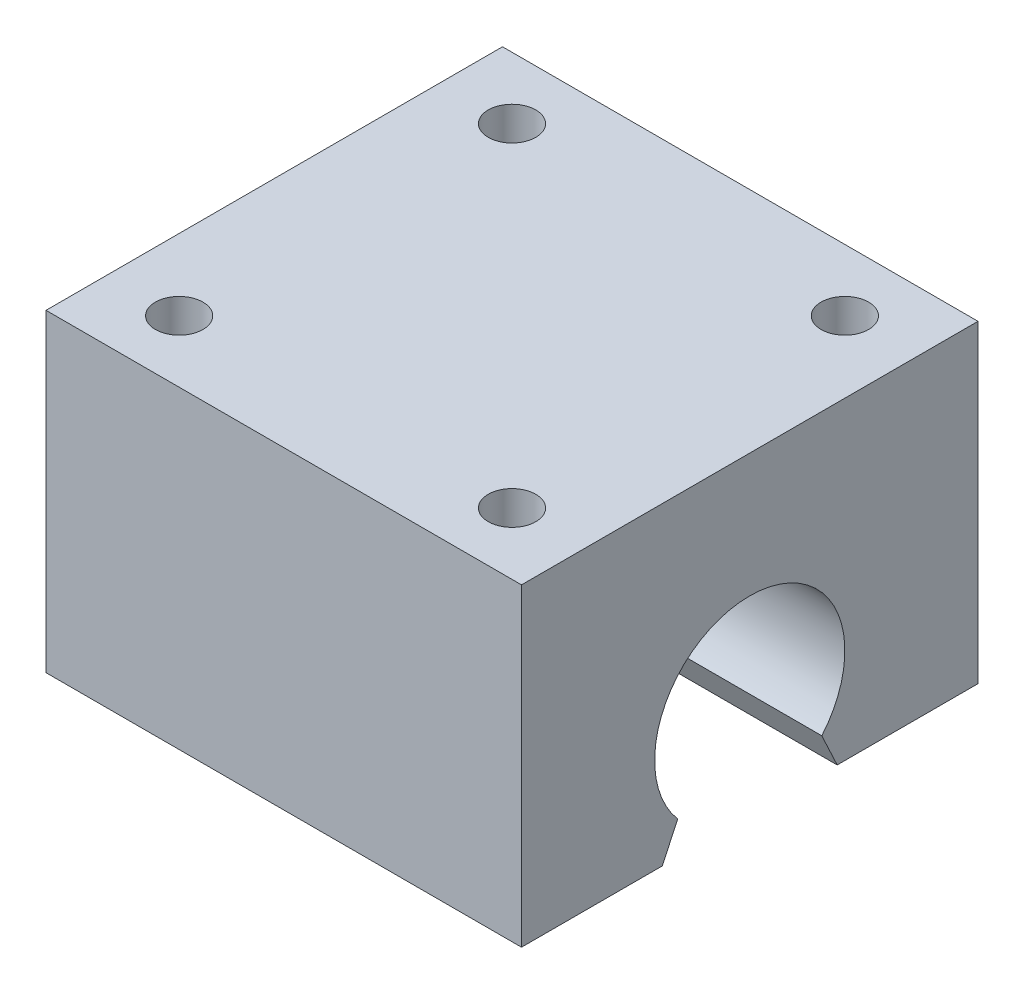
ISO-10303-21;
HEADER;
FILE_DESCRIPTION(('STEP AP214'),'2;1');
FILE_NAME('part.step','',(''),(''),'','','');
FILE_SCHEMA(('AUTOMOTIVE_DESIGN { 1 0 10303 214 1 1 1 1 }'));
ENDSEC;
DATA;
#1=APPLICATION_CONTEXT('core data for automotive mechanical design processes');
#2=APPLICATION_PROTOCOL_DEFINITION('international standard','automotive_design',2000,#1);
#3=PRODUCT_CONTEXT('',#1,'mechanical');
#4=PRODUCT('Part','Part','',(#3));
#5=PRODUCT_RELATED_PRODUCT_CATEGORY('part','',(#4));
#6=PRODUCT_DEFINITION_FORMATION('','',#4);
#7=PRODUCT_DEFINITION_CONTEXT('part definition',#1,'design');
#8=PRODUCT_DEFINITION('design','',#6,#7);
#9=PRODUCT_DEFINITION_SHAPE('','',#8);
#10=(LENGTH_UNIT() NAMED_UNIT(*) SI_UNIT(.MILLI.,.METRE.));
#11=(NAMED_UNIT(*) PLANE_ANGLE_UNIT() SI_UNIT($,.RADIAN.));
#12=(NAMED_UNIT(*) SI_UNIT($,.STERADIAN.) SOLID_ANGLE_UNIT());
#13=UNCERTAINTY_MEASURE_WITH_UNIT(LENGTH_MEASURE(1.E-05),#10,'distance_accuracy_value','');
#14=(GEOMETRIC_REPRESENTATION_CONTEXT(3) GLOBAL_UNCERTAINTY_ASSIGNED_CONTEXT((#13)) GLOBAL_UNIT_ASSIGNED_CONTEXT((#10,
#11,#12)) REPRESENTATION_CONTEXT('',''));
#15=CARTESIAN_POINT('',(0.,0.,0.));
#16=DIRECTION('',(0.,0.,1.));
#17=DIRECTION('',(1.,0.,0.));
#18=AXIS2_PLACEMENT_3D('',#15,#16,#17);
#19=CARTESIAN_POINT('',(50.,-16.5,24.));
#20=DIRECTION('',(0.,0.,-1.));
#21=DIRECTION('',(-1.,0.,0.));
#22=AXIS2_PLACEMENT_3D('',#19,#20,#21);
#23=PLANE('',#22);
#24=DIRECTION('',(0.,-1.,0.));
#25=VECTOR('',#24,1.);
#26=CARTESIAN_POINT('',(0.,-16.5,24.));
#27=LINE('',#26,#25);
#28=CARTESIAN_POINT('',(0.,16.5,24.));
#29=VERTEX_POINT('',#28);
#30=CARTESIAN_POINT('',(0.,-16.5,24.));
#31=VERTEX_POINT('',#30);
#32=EDGE_CURVE('E129',#29,#31,#27,.T.);
#33=ORIENTED_EDGE('',*,*,#32,.T.);
#34=DIRECTION('',(-1.,0.,0.));
#35=VECTOR('',#34,1.);
#36=CARTESIAN_POINT('',(50.,-16.5,24.));
#37=LINE('',#36,#35);
#38=CARTESIAN_POINT('',(50.,-16.5,24.));
#39=VERTEX_POINT('',#38);
#40=EDGE_CURVE('E11',#39,#31,#37,.T.);
#41=ORIENTED_EDGE('',*,*,#40,.F.);
#42=DIRECTION('',(0.,-1.,0.));
#43=VECTOR('',#42,1.);
#44=CARTESIAN_POINT('',(50.,-16.5,24.));
#45=LINE('',#44,#43);
#46=CARTESIAN_POINT('',(50.,16.5,24.));
#47=VERTEX_POINT('',#46);
#48=EDGE_CURVE('E144',#47,#39,#45,.T.);
#49=ORIENTED_EDGE('',*,*,#48,.F.);
#50=DIRECTION('',(-1.,0.,0.));
#51=VECTOR('',#50,1.);
#52=CARTESIAN_POINT('',(50.,16.5,24.));
#53=LINE('',#52,#51);
#54=EDGE_CURVE('E125',#47,#29,#53,.T.);
#55=ORIENTED_EDGE('',*,*,#54,.T.);
#56=EDGE_LOOP('',(#33,#41,#49,#55));
#57=FACE_BOUND('',#56,.T.);
#58=ADVANCED_FACE('F33',(#57),#23,.F.);
#59=CARTESIAN_POINT('',(50.,-16.5,9.19407635955749));
#60=DIRECTION('',(0.,1.,0.));
#61=DIRECTION('',(0.,0.,1.));
#62=AXIS2_PLACEMENT_3D('',#59,#60,#61);
#63=PLANE('',#62);
#64=DIRECTION('',(0.,0.,-1.));
#65=VECTOR('',#64,1.);
#66=CARTESIAN_POINT('',(0.,-16.5,9.19407635955749));
#67=LINE('',#66,#65);
#68=CARTESIAN_POINT('',(0.,-16.5,9.19407635955749));
#69=VERTEX_POINT('',#68);
#70=EDGE_CURVE('E132',#31,#69,#67,.T.);
#71=ORIENTED_EDGE('',*,*,#70,.T.);
#72=DIRECTION('',(-1.,0.,0.));
#73=VECTOR('',#72,1.);
#74=CARTESIAN_POINT('',(50.,-16.5,9.19407635955749));
#75=LINE('',#74,#73);
#76=CARTESIAN_POINT('',(50.,-16.5,9.19407635955749));
#77=VERTEX_POINT('',#76);
#78=EDGE_CURVE('E41',#77,#69,#75,.T.);
#79=ORIENTED_EDGE('',*,*,#78,.F.);
#80=DIRECTION('',(0.,0.,-1.));
#81=VECTOR('',#80,1.);
#82=CARTESIAN_POINT('',(50.,-16.5,9.19407635955749));
#83=LINE('',#82,#81);
#84=EDGE_CURVE('E92',#39,#77,#83,.T.);
#85=ORIENTED_EDGE('',*,*,#84,.F.);
#86=ORIENTED_EDGE('',*,*,#40,.T.);
#87=EDGE_LOOP('',(#71,#79,#85,#86));
#88=FACE_BOUND('',#87,.T.);
#89=ADVANCED_FACE('F236',(#88),#63,.F.);
#90=CARTESIAN_POINT('',(50.,-13.0281858776614,7.5751428466203));
#91=DIRECTION('',(0.,0.4226182617407,0.90630778703665));
#92=DIRECTION('',(0.,-0.90630778703665,0.4226182617407));
#93=AXIS2_PLACEMENT_3D('',#90,#91,#92);
#94=PLANE('',#93);
#95=DIRECTION('',(0.,0.90630778703665,-0.4226182617407));
#96=VECTOR('',#95,1.);
#97=CARTESIAN_POINT('',(0.,-13.0281858776614,7.5751428466203));
#98=LINE('',#97,#96);
#99=CARTESIAN_POINT('',(0.,-13.0281858776614,7.5751428466203));
#100=VERTEX_POINT('',#99);
#101=EDGE_CURVE('E135',#69,#100,#98,.T.);
#102=ORIENTED_EDGE('',*,*,#101,.T.);
#103=DIRECTION('',(-1.,0.,0.));
#104=VECTOR('',#103,1.);
#105=CARTESIAN_POINT('',(50.,-13.0281858776614,7.5751428466203));
#106=LINE('',#105,#104);
#107=CARTESIAN_POINT('',(50.,-13.0281858776614,7.5751428466203));
#108=VERTEX_POINT('',#107);
#109=EDGE_CURVE('E151',#108,#100,#106,.T.);
#110=ORIENTED_EDGE('',*,*,#109,.F.);
#111=DIRECTION('',(0.,0.90630778703665,-0.4226182617407));
#112=VECTOR('',#111,1.);
#113=CARTESIAN_POINT('',(50.,-13.0281858776614,7.5751428466203));
#114=LINE('',#113,#112);
#115=EDGE_CURVE('E159',#77,#108,#114,.T.);
#116=ORIENTED_EDGE('',*,*,#115,.F.);
#117=ORIENTED_EDGE('',*,*,#78,.T.);
#118=EDGE_LOOP('',(#102,#110,#116,#117));
#119=FACE_BOUND('',#118,.T.);
#120=ADVANCED_FACE('F157',(#119),#94,.F.);
#121=CARTESIAN_POINT('',(50.,-6.49999999999999,0.));
#122=DIRECTION('',(-1.,0.,0.));
#123=DIRECTION('',(0.,0.,1.));
#124=AXIS2_PLACEMENT_3D('',#121,#122,#123);
#125=CYLINDRICAL_SURFACE('',#124,10.);
#126=CARTESIAN_POINT('',(0.,-6.49999999999999,0.));
#127=DIRECTION('',(-1.,0.,0.));
#128=DIRECTION('',(0.,0.,-1.));
#129=AXIS2_PLACEMENT_3D('',#126,#127,#128);
#130=CIRCLE('',#129,10.);
#131=CARTESIAN_POINT('',(0.,-13.0281858776613,-7.57514284662032));
#132=VERTEX_POINT('',#131);
#133=EDGE_CURVE('E137',#100,#132,#130,.T.);
#134=ORIENTED_EDGE('',*,*,#133,.T.);
#135=DIRECTION('',(-1.,0.,0.));
#136=VECTOR('',#135,1.);
#137=CARTESIAN_POINT('',(50.,-13.0281858776613,-7.57514284662032));
#138=LINE('',#137,#136);
#139=CARTESIAN_POINT('',(50.,-13.0281858776613,-7.57514284662032));
#140=VERTEX_POINT('',#139);
#141=EDGE_CURVE('E148',#140,#132,#138,.T.);
#142=ORIENTED_EDGE('',*,*,#141,.F.);
#143=CARTESIAN_POINT('',(50.,-6.49999999999999,0.));
#144=DIRECTION('',(-1.,0.,0.));
#145=DIRECTION('',(0.,0.,-1.));
#146=AXIS2_PLACEMENT_3D('',#143,#144,#145);
#147=CIRCLE('',#146,10.);
#148=EDGE_CURVE('E171',#108,#140,#147,.T.);
#149=ORIENTED_EDGE('',*,*,#148,.F.);
#150=ORIENTED_EDGE('',*,*,#109,.T.);
#151=EDGE_LOOP('',(#134,#142,#149,#150));
#152=FACE_BOUND('',#151,.T.);
#153=ADVANCED_FACE('F167',(#152),#125,.F.);
#154=CARTESIAN_POINT('',(50.,-16.5,-9.19407635955749));
#155=DIRECTION('',(0.,0.422618261740694,-0.906307787036652));
#156=DIRECTION('',(0.,0.906307787036652,0.422618261740694));
#157=AXIS2_PLACEMENT_3D('',#154,#155,#156);
#158=PLANE('',#157);
#159=DIRECTION('',(0.,-0.906307787036652,-0.422618261740694));
#160=VECTOR('',#159,1.);
#161=CARTESIAN_POINT('',(0.,-16.5,-9.19407635955749));
#162=LINE('',#161,#160);
#163=CARTESIAN_POINT('',(0.,-16.5,-9.19407635955749));
#164=VERTEX_POINT('',#163);
#165=EDGE_CURVE('E139',#132,#164,#162,.T.);
#166=ORIENTED_EDGE('',*,*,#165,.T.);
#167=DIRECTION('',(-1.,0.,0.));
#168=VECTOR('',#167,1.);
#169=CARTESIAN_POINT('',(50.,-16.5,-9.19407635955749));
#170=LINE('',#169,#168);
#171=CARTESIAN_POINT('',(50.,-16.5,-9.19407635955749));
#172=VERTEX_POINT('',#171);
#173=EDGE_CURVE('E120',#172,#164,#170,.T.);
#174=ORIENTED_EDGE('',*,*,#173,.F.);
#175=DIRECTION('',(0.,-0.906307787036652,-0.422618261740694));
#176=VECTOR('',#175,1.);
#177=CARTESIAN_POINT('',(50.,-16.5,-9.19407635955749));
#178=LINE('',#177,#176);
#179=EDGE_CURVE('E111',#140,#172,#178,.T.);
#180=ORIENTED_EDGE('',*,*,#179,.F.);
#181=ORIENTED_EDGE('',*,*,#141,.T.);
#182=EDGE_LOOP('',(#166,#174,#180,#181));
#183=FACE_BOUND('',#182,.T.);
#184=ADVANCED_FACE('F170',(#183),#158,.F.);
#185=CARTESIAN_POINT('',(50.,-16.5,-24.));
#186=DIRECTION('',(0.,1.,0.));
#187=DIRECTION('',(0.,0.,1.));
#188=AXIS2_PLACEMENT_3D('',#185,#186,#187);
#189=PLANE('',#188);
#190=DIRECTION('',(0.,0.,-1.));
#191=VECTOR('',#190,1.);
#192=CARTESIAN_POINT('',(0.,-16.5,-24.));
#193=LINE('',#192,#191);
#194=CARTESIAN_POINT('',(0.,-16.5,-24.));
#195=VERTEX_POINT('',#194);
#196=EDGE_CURVE('E119',#164,#195,#193,.T.);
#197=ORIENTED_EDGE('',*,*,#196,.T.);
#198=DIRECTION('',(-1.,0.,0.));
#199=VECTOR('',#198,1.);
#200=CARTESIAN_POINT('',(50.,-16.5,-24.));
#201=LINE('',#200,#199);
#202=CARTESIAN_POINT('',(50.,-16.5,-24.));
#203=VERTEX_POINT('',#202);
#204=EDGE_CURVE('E116',#203,#195,#201,.T.);
#205=ORIENTED_EDGE('',*,*,#204,.F.);
#206=DIRECTION('',(0.,0.,-1.));
#207=VECTOR('',#206,1.);
#208=CARTESIAN_POINT('',(50.,-16.5,-24.));
#209=LINE('',#208,#207);
#210=EDGE_CURVE('E105',#172,#203,#209,.T.);
#211=ORIENTED_EDGE('',*,*,#210,.F.);
#212=ORIENTED_EDGE('',*,*,#173,.T.);
#213=EDGE_LOOP('',(#197,#205,#211,#212));
#214=FACE_BOUND('',#213,.T.);
#215=ADVANCED_FACE('F117',(#214),#189,.F.);
#216=CARTESIAN_POINT('',(50.,-16.5,-24.));
#217=DIRECTION('',(0.,0.,1.));
#218=DIRECTION('',(1.,0.,0.));
#219=AXIS2_PLACEMENT_3D('',#216,#217,#218);
#220=PLANE('',#219);
#221=DIRECTION('',(0.,1.,0.));
#222=VECTOR('',#221,1.);
#223=CARTESIAN_POINT('',(0.,-16.5,-24.));
#224=LINE('',#223,#222);
#225=CARTESIAN_POINT('',(0.,16.5,-24.));
#226=VERTEX_POINT('',#225);
#227=EDGE_CURVE('E78',#195,#226,#224,.T.);
#228=ORIENTED_EDGE('',*,*,#227,.T.);
#229=DIRECTION('',(-1.,0.,0.));
#230=VECTOR('',#229,1.);
#231=CARTESIAN_POINT('',(50.,16.5,-24.));
#232=LINE('',#231,#230);
#233=CARTESIAN_POINT('',(50.,16.5,-24.));
#234=VERTEX_POINT('',#233);
#235=EDGE_CURVE('E121',#234,#226,#232,.T.);
#236=ORIENTED_EDGE('',*,*,#235,.F.);
#237=DIRECTION('',(0.,1.,0.));
#238=VECTOR('',#237,1.);
#239=CARTESIAN_POINT('',(50.,-16.5,-24.));
#240=LINE('',#239,#238);
#241=EDGE_CURVE('E109',#203,#234,#240,.T.);
#242=ORIENTED_EDGE('',*,*,#241,.F.);
#243=ORIENTED_EDGE('',*,*,#204,.T.);
#244=EDGE_LOOP('',(#228,#236,#242,#243));
#245=FACE_BOUND('',#244,.T.);
#246=ADVANCED_FACE('F123',(#245),#220,.F.);
#247=CARTESIAN_POINT('',(50.,16.5,-24.));
#248=DIRECTION('',(0.,-1.,0.));
#249=DIRECTION('',(0.,0.,-1.));
#250=AXIS2_PLACEMENT_3D('',#247,#248,#249);
#251=PLANE('',#250);
#252=CARTESIAN_POINT('',(7.5,16.5,17.5));
#253=DIRECTION('',(0.,1.,0.));
#254=DIRECTION('',(0.,0.,1.));
#255=AXIS2_PLACEMENT_3D('',#252,#253,#254);
#256=CIRCLE('',#255,2.5);
#257=CARTESIAN_POINT('',(7.5,16.5,20.));
#258=VERTEX_POINT('',#257);
#259=EDGE_CURVE('E195',#258,#258,#256,.T.);
#260=ORIENTED_EDGE('',*,*,#259,.F.);
#261=EDGE_LOOP('',(#260));
#262=FACE_BOUND('',#261,.T.);
#263=CARTESIAN_POINT('',(42.5,16.5,17.5));
#264=DIRECTION('',(0.,1.,0.));
#265=DIRECTION('',(0.,0.,1.));
#266=AXIS2_PLACEMENT_3D('',#263,#264,#265);
#267=CIRCLE('',#266,2.5);
#268=CARTESIAN_POINT('',(42.5,16.5,20.));
#269=VERTEX_POINT('',#268);
#270=EDGE_CURVE('E189',#269,#269,#267,.T.);
#271=ORIENTED_EDGE('',*,*,#270,.F.);
#272=EDGE_LOOP('',(#271));
#273=FACE_BOUND('',#272,.T.);
#274=CARTESIAN_POINT('',(42.5,16.5,-17.5));
#275=DIRECTION('',(0.,1.,0.));
#276=DIRECTION('',(0.,0.,1.));
#277=AXIS2_PLACEMENT_3D('',#274,#275,#276);
#278=CIRCLE('',#277,2.5);
#279=CARTESIAN_POINT('',(42.5,16.5,-15.));
#280=VERTEX_POINT('',#279);
#281=EDGE_CURVE('E183',#280,#280,#278,.T.);
#282=ORIENTED_EDGE('',*,*,#281,.F.);
#283=EDGE_LOOP('',(#282));
#284=FACE_BOUND('',#283,.T.);
#285=CARTESIAN_POINT('',(7.5,16.5,-17.5));
#286=DIRECTION('',(0.,1.,0.));
#287=DIRECTION('',(0.,0.,1.));
#288=AXIS2_PLACEMENT_3D('',#285,#286,#287);
#289=CIRCLE('',#288,2.5);
#290=CARTESIAN_POINT('',(7.5,16.5,-15.));
#291=VERTEX_POINT('',#290);
#292=EDGE_CURVE('E177',#291,#291,#289,.T.);
#293=ORIENTED_EDGE('',*,*,#292,.F.);
#294=EDGE_LOOP('',(#293));
#295=FACE_BOUND('',#294,.T.);
#296=DIRECTION('',(0.,0.,1.));
#297=VECTOR('',#296,1.);
#298=CARTESIAN_POINT('',(0.,16.5,-24.));
#299=LINE('',#298,#297);
#300=EDGE_CURVE('E84',#226,#29,#299,.T.);
#301=ORIENTED_EDGE('',*,*,#300,.T.);
#302=ORIENTED_EDGE('',*,*,#54,.F.);
#303=DIRECTION('',(0.,0.,1.));
#304=VECTOR('',#303,1.);
#305=CARTESIAN_POINT('',(50.,16.5,-24.));
#306=LINE('',#305,#304);
#307=EDGE_CURVE('E49',#234,#47,#306,.T.);
#308=ORIENTED_EDGE('',*,*,#307,.F.);
#309=ORIENTED_EDGE('',*,*,#235,.T.);
#310=EDGE_LOOP('',(#301,#302,#308,#309));
#311=FACE_BOUND('',#310,.T.);
#312=ADVANCED_FACE('F210',(#262,#273,#284,#295,#311),#251,.F.);
#313=CARTESIAN_POINT('',(50.,-6.49999999999999,0.));
#314=DIRECTION('',(1.,0.,0.));
#315=DIRECTION('',(0.,0.,-1.));
#316=AXIS2_PLACEMENT_3D('',#313,#314,#315);
#317=PLANE('',#316);
#318=ORIENTED_EDGE('',*,*,#48,.T.);
#319=ORIENTED_EDGE('',*,*,#84,.T.);
#320=ORIENTED_EDGE('',*,*,#115,.T.);
#321=ORIENTED_EDGE('',*,*,#148,.T.);
#322=ORIENTED_EDGE('',*,*,#179,.T.);
#323=ORIENTED_EDGE('',*,*,#210,.T.);
#324=ORIENTED_EDGE('',*,*,#241,.T.);
#325=ORIENTED_EDGE('',*,*,#307,.T.);
#326=EDGE_LOOP('',(#318,#319,#320,#321,#322,#323,#324,#325));
#327=FACE_BOUND('',#326,.T.);
#328=ADVANCED_FACE('F107',(#327),#317,.T.);
#329=CARTESIAN_POINT('',(0.,-6.49999999999999,0.));
#330=DIRECTION('',(1.,0.,0.));
#331=DIRECTION('',(0.,0.,-1.));
#332=AXIS2_PLACEMENT_3D('',#329,#330,#331);
#333=PLANE('',#332);
#334=ORIENTED_EDGE('',*,*,#32,.F.);
#335=ORIENTED_EDGE('',*,*,#300,.F.);
#336=ORIENTED_EDGE('',*,*,#227,.F.);
#337=ORIENTED_EDGE('',*,*,#196,.F.);
#338=ORIENTED_EDGE('',*,*,#165,.F.);
#339=ORIENTED_EDGE('',*,*,#133,.F.);
#340=ORIENTED_EDGE('',*,*,#101,.F.);
#341=ORIENTED_EDGE('',*,*,#70,.F.);
#342=EDGE_LOOP('',(#334,#335,#336,#337,#338,#339,#340,#341));
#343=FACE_BOUND('',#342,.T.);
#344=ADVANCED_FACE('F163',(#343),#333,.F.);
#345=CARTESIAN_POINT('',(7.5,11.5,-17.5));
#346=DIRECTION('',(0.,1.,0.));
#347=DIRECTION('',(0.,0.,1.));
#348=AXIS2_PLACEMENT_3D('',#345,#346,#347);
#349=CYLINDRICAL_SURFACE('',#348,2.5);
#350=CARTESIAN_POINT('',(7.5,11.5,-17.5));
#351=DIRECTION('',(0.,1.,0.));
#352=DIRECTION('',(0.,0.,1.));
#353=AXIS2_PLACEMENT_3D('',#350,#351,#352);
#354=CIRCLE('',#353,2.5);
#355=CARTESIAN_POINT('',(7.5,11.5,-15.));
#356=VERTEX_POINT('',#355);
#357=EDGE_CURVE('E133',#356,#356,#354,.T.);
#358=ORIENTED_EDGE('',*,*,#357,.F.);
#359=EDGE_LOOP('',(#358));
#360=FACE_BOUND('',#359,.T.);
#361=ORIENTED_EDGE('',*,*,#292,.T.);
#362=EDGE_LOOP('',(#361));
#363=FACE_BOUND('',#362,.T.);
#364=ADVANCED_FACE('F220',(#360,#363),#349,.F.);
#365=CARTESIAN_POINT('',(7.5,11.5,-17.5));
#366=DIRECTION('',(0.,1.,0.));
#367=DIRECTION('',(0.,0.,1.));
#368=AXIS2_PLACEMENT_3D('',#365,#366,#367);
#369=PLANE('',#368);
#370=ORIENTED_EDGE('',*,*,#357,.T.);
#371=EDGE_LOOP('',(#370));
#372=FACE_BOUND('',#371,.T.);
#373=ADVANCED_FACE('F222',(#372),#369,.T.);
#374=CARTESIAN_POINT('',(42.5,11.5,-17.5));
#375=DIRECTION('',(0.,1.,0.));
#376=DIRECTION('',(0.,0.,1.));
#377=AXIS2_PLACEMENT_3D('',#374,#375,#376);
#378=CYLINDRICAL_SURFACE('',#377,2.5);
#379=CARTESIAN_POINT('',(42.5,11.5,-17.5));
#380=DIRECTION('',(0.,1.,0.));
#381=DIRECTION('',(0.,0.,1.));
#382=AXIS2_PLACEMENT_3D('',#379,#380,#381);
#383=CIRCLE('',#382,2.5);
#384=CARTESIAN_POINT('',(42.5,11.5,-15.));
#385=VERTEX_POINT('',#384);
#386=EDGE_CURVE('E180',#385,#385,#383,.T.);
#387=ORIENTED_EDGE('',*,*,#386,.F.);
#388=EDGE_LOOP('',(#387));
#389=FACE_BOUND('',#388,.T.);
#390=ORIENTED_EDGE('',*,*,#281,.T.);
#391=EDGE_LOOP('',(#390));
#392=FACE_BOUND('',#391,.T.);
#393=ADVANCED_FACE('F229',(#389,#392),#378,.F.);
#394=CARTESIAN_POINT('',(42.5,11.5,-17.5));
#395=DIRECTION('',(0.,1.,0.));
#396=DIRECTION('',(0.,0.,1.));
#397=AXIS2_PLACEMENT_3D('',#394,#395,#396);
#398=PLANE('',#397);
#399=ORIENTED_EDGE('',*,*,#386,.T.);
#400=EDGE_LOOP('',(#399));
#401=FACE_BOUND('',#400,.T.);
#402=ADVANCED_FACE('F289',(#401),#398,.T.);
#403=CARTESIAN_POINT('',(42.5,11.5,17.5));
#404=DIRECTION('',(0.,1.,0.));
#405=DIRECTION('',(0.,0.,1.));
#406=AXIS2_PLACEMENT_3D('',#403,#404,#405);
#407=CYLINDRICAL_SURFACE('',#406,2.5);
#408=CARTESIAN_POINT('',(42.5,11.5,17.5));
#409=DIRECTION('',(0.,1.,0.));
#410=DIRECTION('',(0.,0.,1.));
#411=AXIS2_PLACEMENT_3D('',#408,#409,#410);
#412=CIRCLE('',#411,2.5);
#413=CARTESIAN_POINT('',(42.5,11.5,20.));
#414=VERTEX_POINT('',#413);
#415=EDGE_CURVE('E186',#414,#414,#412,.T.);
#416=ORIENTED_EDGE('',*,*,#415,.F.);
#417=EDGE_LOOP('',(#416));
#418=FACE_BOUND('',#417,.T.);
#419=ORIENTED_EDGE('',*,*,#270,.T.);
#420=EDGE_LOOP('',(#419));
#421=FACE_BOUND('',#420,.T.);
#422=ADVANCED_FACE('F299',(#418,#421),#407,.F.);
#423=CARTESIAN_POINT('',(42.5,11.5,17.5));
#424=DIRECTION('',(0.,1.,0.));
#425=DIRECTION('',(0.,0.,1.));
#426=AXIS2_PLACEMENT_3D('',#423,#424,#425);
#427=PLANE('',#426);
#428=ORIENTED_EDGE('',*,*,#415,.T.);
#429=EDGE_LOOP('',(#428));
#430=FACE_BOUND('',#429,.T.);
#431=ADVANCED_FACE('F206',(#430),#427,.T.);
#432=CARTESIAN_POINT('',(7.5,11.5,17.5));
#433=DIRECTION('',(0.,1.,0.));
#434=DIRECTION('',(0.,0.,1.));
#435=AXIS2_PLACEMENT_3D('',#432,#433,#434);
#436=CYLINDRICAL_SURFACE('',#435,2.5);
#437=CARTESIAN_POINT('',(7.5,11.5,17.5));
#438=DIRECTION('',(0.,1.,0.));
#439=DIRECTION('',(0.,0.,1.));
#440=AXIS2_PLACEMENT_3D('',#437,#438,#439);
#441=CIRCLE('',#440,2.5);
#442=CARTESIAN_POINT('',(7.5,11.5,20.));
#443=VERTEX_POINT('',#442);
#444=EDGE_CURVE('E192',#443,#443,#441,.T.);
#445=ORIENTED_EDGE('',*,*,#444,.F.);
#446=EDGE_LOOP('',(#445));
#447=FACE_BOUND('',#446,.T.);
#448=ORIENTED_EDGE('',*,*,#259,.T.);
#449=EDGE_LOOP('',(#448));
#450=FACE_BOUND('',#449,.T.);
#451=ADVANCED_FACE('F203',(#447,#450),#436,.F.);
#452=CARTESIAN_POINT('',(7.5,11.5,17.5));
#453=DIRECTION('',(0.,1.,0.));
#454=DIRECTION('',(0.,0.,1.));
#455=AXIS2_PLACEMENT_3D('',#452,#453,#454);
#456=PLANE('',#455);
#457=ORIENTED_EDGE('',*,*,#444,.T.);
#458=EDGE_LOOP('',(#457));
#459=FACE_BOUND('',#458,.T.);
#460=ADVANCED_FACE('F201',(#459),#456,.T.);
#461=CLOSED_SHELL('',(#58,#89,#120,#153,#184,#215,#246,#312,#328,#344,#364,#373,#393,#402,#422,
#431,#451,#460));
#462=MANIFOLD_SOLID_BREP('B2',#461);
#463=ADVANCED_BREP_SHAPE_REPRESENTATION('',(#18,#462),#14);
#464=SHAPE_DEFINITION_REPRESENTATION(#9,#463);
ENDSEC;
END-ISO-10303-21;
